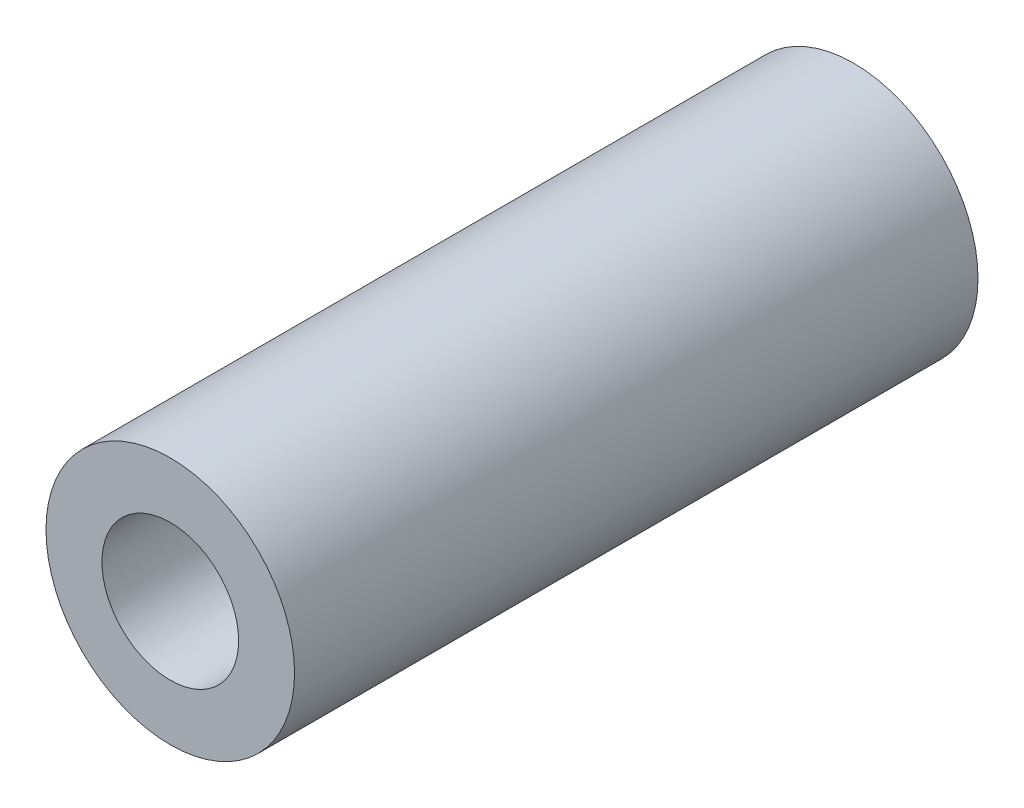
ISO-10303-21;
HEADER;
FILE_DESCRIPTION(('STEP AP214'),'2;1');
FILE_NAME('part.step','',(''),(''),'','','');
FILE_SCHEMA(('AUTOMOTIVE_DESIGN { 1 0 10303 214 1 1 1 1 }'));
ENDSEC;
DATA;
#1=APPLICATION_CONTEXT('core data for automotive mechanical design processes');
#2=APPLICATION_PROTOCOL_DEFINITION('international standard','automotive_design',2000,#1);
#3=PRODUCT_CONTEXT('',#1,'mechanical');
#4=PRODUCT('Part','Part','',(#3));
#5=PRODUCT_RELATED_PRODUCT_CATEGORY('part','',(#4));
#6=PRODUCT_DEFINITION_FORMATION('','',#4);
#7=PRODUCT_DEFINITION_CONTEXT('part definition',#1,'design');
#8=PRODUCT_DEFINITION('design','',#6,#7);
#9=PRODUCT_DEFINITION_SHAPE('','',#8);
#10=(LENGTH_UNIT() NAMED_UNIT(*) SI_UNIT(.MILLI.,.METRE.));
#11=(NAMED_UNIT(*) PLANE_ANGLE_UNIT() SI_UNIT($,.RADIAN.));
#12=(NAMED_UNIT(*) SI_UNIT($,.STERADIAN.) SOLID_ANGLE_UNIT());
#13=UNCERTAINTY_MEASURE_WITH_UNIT(LENGTH_MEASURE(1.E-05),#10,'distance_accuracy_value','');
#14=(GEOMETRIC_REPRESENTATION_CONTEXT(3) GLOBAL_UNCERTAINTY_ASSIGNED_CONTEXT((#13)) GLOBAL_UNIT_ASSIGNED_CONTEXT((#10,
#11,#12)) REPRESENTATION_CONTEXT('',''));
#15=CARTESIAN_POINT('',(0.,0.,0.));
#16=DIRECTION('',(0.,0.,1.));
#17=DIRECTION('',(1.,0.,0.));
#18=AXIS2_PLACEMENT_3D('',#15,#16,#17);
#19=CARTESIAN_POINT('',(0.,0.,11.));
#20=DIRECTION('',(0.,0.,1.));
#21=DIRECTION('',(1.,0.,0.));
#22=AXIS2_PLACEMENT_3D('',#19,#20,#21);
#23=PLANE('',#22);
#24=CARTESIAN_POINT('',(0.,0.,11.));
#25=DIRECTION('',(0.,0.,1.));
#26=DIRECTION('',(1.,0.,0.));
#27=AXIS2_PLACEMENT_3D('',#24,#25,#26);
#28=CIRCLE('',#27,2.);
#29=CARTESIAN_POINT('',(2.,0.,11.));
#30=VERTEX_POINT('',#29);
#31=EDGE_CURVE('E10',#30,#30,#28,.T.);
#32=ORIENTED_EDGE('',*,*,#31,.T.);
#33=EDGE_LOOP('',(#32));
#34=FACE_BOUND('',#33,.T.);
#35=CARTESIAN_POINT('',(0.,0.,11.));
#36=DIRECTION('',(0.,0.,1.));
#37=DIRECTION('',(1.,0.,0.));
#38=AXIS2_PLACEMENT_3D('',#35,#36,#37);
#39=CIRCLE('',#38,1.1);
#40=CARTESIAN_POINT('',(1.1,0.,11.));
#41=VERTEX_POINT('',#40);
#42=EDGE_CURVE('E50',#41,#41,#39,.T.);
#43=ORIENTED_EDGE('',*,*,#42,.F.);
#44=EDGE_LOOP('',(#43));
#45=FACE_BOUND('',#44,.T.);
#46=ADVANCED_FACE('F37',(#34,#45),#23,.T.);
#47=CARTESIAN_POINT('',(0.,0.,0.));
#48=DIRECTION('',(0.,0.,1.));
#49=DIRECTION('',(1.,0.,0.));
#50=AXIS2_PLACEMENT_3D('',#47,#48,#49);
#51=PLANE('',#50);
#52=CARTESIAN_POINT('',(0.,0.,0.));
#53=DIRECTION('',(0.,0.,1.));
#54=DIRECTION('',(1.,0.,0.));
#55=AXIS2_PLACEMENT_3D('',#52,#53,#54);
#56=CIRCLE('',#55,2.);
#57=CARTESIAN_POINT('',(2.,0.,0.));
#58=VERTEX_POINT('',#57);
#59=EDGE_CURVE('E41',#58,#58,#56,.T.);
#60=ORIENTED_EDGE('',*,*,#59,.F.);
#61=EDGE_LOOP('',(#60));
#62=FACE_BOUND('',#61,.T.);
#63=CARTESIAN_POINT('',(0.,0.,0.));
#64=DIRECTION('',(0.,0.,1.));
#65=DIRECTION('',(1.,0.,0.));
#66=AXIS2_PLACEMENT_3D('',#63,#64,#65);
#67=CIRCLE('',#66,1.1);
#68=CARTESIAN_POINT('',(1.1,0.,0.));
#69=VERTEX_POINT('',#68);
#70=EDGE_CURVE('E52',#69,#69,#67,.T.);
#71=ORIENTED_EDGE('',*,*,#70,.T.);
#72=EDGE_LOOP('',(#71));
#73=FACE_BOUND('',#72,.T.);
#74=ADVANCED_FACE('F64',(#62,#73),#51,.F.);
#75=CARTESIAN_POINT('',(0.,0.,11.));
#76=DIRECTION('',(0.,0.,-1.));
#77=DIRECTION('',(-1.,0.,0.));
#78=AXIS2_PLACEMENT_3D('',#75,#76,#77);
#79=CYLINDRICAL_SURFACE('',#78,2.);
#80=ORIENTED_EDGE('',*,*,#31,.F.);
#81=EDGE_LOOP('',(#80));
#82=FACE_BOUND('',#81,.T.);
#83=ORIENTED_EDGE('',*,*,#59,.T.);
#84=EDGE_LOOP('',(#83));
#85=FACE_BOUND('',#84,.T.);
#86=ADVANCED_FACE('F39',(#82,#85),#79,.T.);
#87=CARTESIAN_POINT('',(0.,0.,11.));
#88=DIRECTION('',(0.,0.,-1.));
#89=DIRECTION('',(-1.,0.,0.));
#90=AXIS2_PLACEMENT_3D('',#87,#88,#89);
#91=CYLINDRICAL_SURFACE('',#90,1.1);
#92=ORIENTED_EDGE('',*,*,#42,.T.);
#93=EDGE_LOOP('',(#92));
#94=FACE_BOUND('',#93,.T.);
#95=ORIENTED_EDGE('',*,*,#70,.F.);
#96=EDGE_LOOP('',(#95));
#97=FACE_BOUND('',#96,.T.);
#98=ADVANCED_FACE('F60',(#94,#97),#91,.F.);
#99=CLOSED_SHELL('',(#46,#74,#86,#98));
#100=MANIFOLD_SOLID_BREP('B2',#99);
#101=ADVANCED_BREP_SHAPE_REPRESENTATION('',(#18,#100),#14);
#102=SHAPE_DEFINITION_REPRESENTATION(#9,#101);
ENDSEC;
END-ISO-10303-21;
